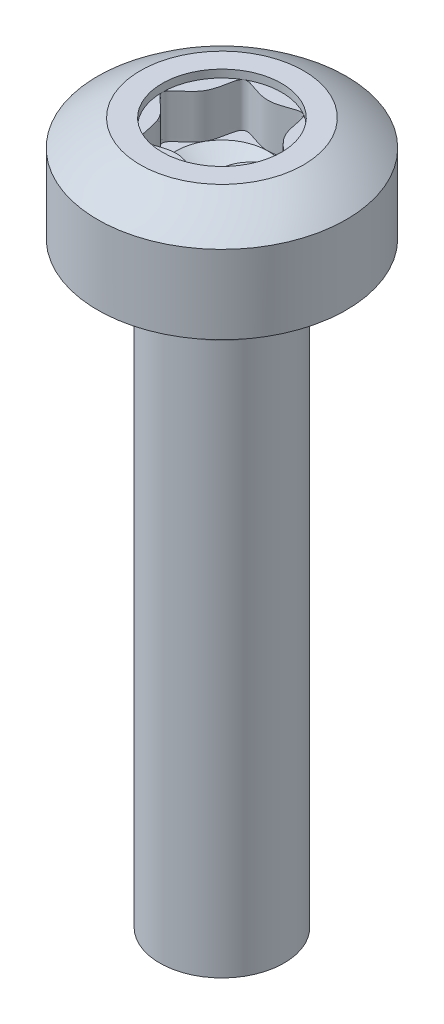
ISO-10303-21;
HEADER;
FILE_DESCRIPTION(('STEP AP214'),'2;1');
FILE_NAME('part.step','',(''),(''),'','','');
FILE_SCHEMA(('AUTOMOTIVE_DESIGN { 1 0 10303 214 1 1 1 1 }'));
ENDSEC;
DATA;
#1=APPLICATION_CONTEXT('core data for automotive mechanical design processes');
#2=APPLICATION_PROTOCOL_DEFINITION('international standard','automotive_design',2000,#1);
#3=PRODUCT_CONTEXT('',#1,'mechanical');
#4=PRODUCT('Part','Part','',(#3));
#5=PRODUCT_RELATED_PRODUCT_CATEGORY('part','',(#4));
#6=PRODUCT_DEFINITION_FORMATION('','',#4);
#7=PRODUCT_DEFINITION_CONTEXT('part definition',#1,'design');
#8=PRODUCT_DEFINITION('design','',#6,#7);
#9=PRODUCT_DEFINITION_SHAPE('','',#8);
#10=(LENGTH_UNIT() NAMED_UNIT(*) SI_UNIT(.MILLI.,.METRE.));
#11=(NAMED_UNIT(*) PLANE_ANGLE_UNIT() SI_UNIT($,.RADIAN.));
#12=(NAMED_UNIT(*) SI_UNIT($,.STERADIAN.) SOLID_ANGLE_UNIT());
#13=UNCERTAINTY_MEASURE_WITH_UNIT(LENGTH_MEASURE(1.E-05),#10,'distance_accuracy_value','');
#14=(GEOMETRIC_REPRESENTATION_CONTEXT(3) GLOBAL_UNCERTAINTY_ASSIGNED_CONTEXT((#13)) GLOBAL_UNIT_ASSIGNED_CONTEXT((#10,
#11,#12)) REPRESENTATION_CONTEXT('',''));
#15=CARTESIAN_POINT('',(0.,0.,0.));
#16=DIRECTION('',(0.,0.,1.));
#17=DIRECTION('',(1.,0.,0.));
#18=AXIS2_PLACEMENT_3D('',#15,#16,#17);
#19=CARTESIAN_POINT('',(0.,0.,0.));
#20=DIRECTION('',(0.,-1.,0.));
#21=DIRECTION('',(0.,0.,-1.));
#22=AXIS2_PLACEMENT_3D('',#19,#20,#21);
#23=CYLINDRICAL_SURFACE('',#22,2.5);
#24=CARTESIAN_POINT('',(0.,12.,0.));
#25=DIRECTION('',(0.,-1.,0.));
#26=DIRECTION('',(0.,0.,-1.));
#27=AXIS2_PLACEMENT_3D('',#24,#25,#26);
#28=CIRCLE('',#27,2.5);
#29=CARTESIAN_POINT('',(0.,12.,-2.5));
#30=VERTEX_POINT('',#29);
#31=EDGE_CURVE('E139',#30,#30,#28,.T.);
#32=ORIENTED_EDGE('',*,*,#31,.F.);
#33=EDGE_LOOP('',(#32));
#34=FACE_BOUND('',#33,.T.);
#35=CARTESIAN_POINT('',(0.,13.575,0.));
#36=DIRECTION('',(0.,-1.,0.));
#37=DIRECTION('',(0.,0.,-1.));
#38=AXIS2_PLACEMENT_3D('',#35,#36,#37);
#39=CIRCLE('',#38,2.5);
#40=CARTESIAN_POINT('',(2.5,13.575,0.));
#41=VERTEX_POINT('',#40);
#42=EDGE_CURVE('E144',#41,#41,#39,.T.);
#43=ORIENTED_EDGE('',*,*,#42,.T.);
#44=EDGE_LOOP('',(#43));
#45=FACE_BOUND('',#44,.T.);
#46=ADVANCED_FACE('F41',(#34,#45),#23,.T.);
#47=CARTESIAN_POINT('',(1.25,12.,0.));
#48=DIRECTION('',(0.,-1.,0.));
#49=DIRECTION('',(0.,0.,-1.));
#50=AXIS2_PLACEMENT_3D('',#47,#48,#49);
#51=PLANE('',#50);
#52=ORIENTED_EDGE('',*,*,#31,.T.);
#53=EDGE_LOOP('',(#52));
#54=FACE_BOUND('',#53,.T.);
#55=CARTESIAN_POINT('',(0.,12.,0.));
#56=DIRECTION('',(0.,-1.,0.));
#57=DIRECTION('',(0.,0.,-1.));
#58=AXIS2_PLACEMENT_3D('',#55,#56,#57);
#59=CIRCLE('',#58,1.25);
#60=CARTESIAN_POINT('',(0.,12.,-1.25));
#61=VERTEX_POINT('',#60);
#62=EDGE_CURVE('E304',#61,#61,#59,.T.);
#63=ORIENTED_EDGE('',*,*,#62,.F.);
#64=EDGE_LOOP('',(#63));
#65=FACE_BOUND('',#64,.T.);
#66=ADVANCED_FACE('F273',(#54,#65),#51,.T.);
#67=CARTESIAN_POINT('',(0.,10.4525010008008,0.));
#68=DIRECTION('',(0.,-1.,0.));
#69=DIRECTION('',(1.,0.,0.));
#70=AXIS2_PLACEMENT_3D('',#67,#68,#69);
#71=SPHERICAL_SURFACE('',#70,4.);
#72=CARTESIAN_POINT('',(0.,14.1,0.));
#73=DIRECTION('',(0.,1.,0.));
#74=DIRECTION('',(0.,0.,1.));
#75=AXIS2_PLACEMENT_3D('',#72,#73,#74);
#76=CIRCLE('',#75,1.64187424939939);
#77=CARTESIAN_POINT('',(1.6418742493994,14.1,0.));
#78=VERTEX_POINT('',#77);
#79=EDGE_CURVE('E148',#78,#78,#76,.T.);
#80=CARTESIAN_POINT('',(2.5,13.575,0.));
#81=CARTESIAN_POINT('',(2.49179811667303,13.5815667633569,0.));
#82=CARTESIAN_POINT('',(2.48357035879982,13.5881012093958,0.));
#83=CARTESIAN_POINT('',(2.46706360738007,13.6011050642602,0.));
#84=CARTESIAN_POINT('',(2.45878461383353,13.6075744730857,0.));
#85=CARTESIAN_POINT('',(2.44217590448631,13.6204478509464,0.));
#86=CARTESIAN_POINT('',(2.43384618868563,13.6268518199815,0.));
#87=CARTESIAN_POINT('',(2.4171365522514,13.6395939208298,0.));
#88=CARTESIAN_POINT('',(2.40875663161786,13.645932052643,0.));
#89=CARTESIAN_POINT('',(2.39194710582831,13.6585420854141,0.));
#90=CARTESIAN_POINT('',(2.3835175006723,13.6648139863721,0.));
#91=CARTESIAN_POINT('',(2.36660912929461,13.67729116799,0.));
#92=CARTESIAN_POINT('',(2.35813036307294,13.6834964486499,0.));
#93=CARTESIAN_POINT('',(2.34112419605702,13.6958400043448,0.));
#94=CARTESIAN_POINT('',(2.33259679526277,13.7019782793799,0.));
#95=CARTESIAN_POINT('',(2.31549388861922,13.7141874426645,0.));
#96=CARTESIAN_POINT('',(2.30691838276991,13.7202583309141,0.));
#97=CARTESIAN_POINT('',(2.28971979851967,13.7323323436503,0.));
#98=CARTESIAN_POINT('',(2.28109672011874,13.738335468137,0.));
#99=CARTESIAN_POINT('',(2.26380352622309,13.7502735805781,0.));
#100=CARTESIAN_POINT('',(2.25513341072836,13.7562085685325,0.));
#101=CARTESIAN_POINT('',(2.23774668102368,13.7680100393707,0.));
#102=CARTESIAN_POINT('',(2.22903006681372,13.7738765222544,0.));
#103=CARTESIAN_POINT('',(2.2115508809445,13.7855406186668,0.));
#104=CARTESIAN_POINT('',(2.20278830928525,13.7913382321955,0.));
#105=CARTESIAN_POINT('',(2.18521775263718,13.8028642298896,0.));
#106=CARTESIAN_POINT('',(2.17640976764836,13.8085926140551,0.));
#107=CARTESIAN_POINT('',(2.15874893128084,13.8199797973138,0.));
#108=CARTESIAN_POINT('',(2.14989607990214,13.8256385964071,0.));
#109=CARTESIAN_POINT('',(2.13214606048059,13.8368862581331,0.));
#110=CARTESIAN_POINT('',(2.12324889243774,13.8424751207659,0.));
#111=CARTESIAN_POINT('',(2.10541079216548,13.8535825625255,0.));
#112=CARTESIAN_POINT('',(2.09646985993607,13.8591011416525,0.));
#113=CARTESIAN_POINT('',(2.07854478648588,13.8700676737193,0.));
#114=CARTESIAN_POINT('',(2.06956064526509,13.8755156266593,0.));
#115=CARTESIAN_POINT('',(2.05154971171041,13.8863405680567,0.));
#116=CARTESIAN_POINT('',(2.04252291937652,13.8917175565141,0.));
#117=CARTESIAN_POINT('',(2.02442724412237,13.9024002350577,0.));
#118=CARTESIAN_POINT('',(2.01535836120211,13.9077059251437,0.));
#119=CARTESIAN_POINT('',(1.99717906791562,13.9182456774829,0.));
#120=CARTESIAN_POINT('',(1.98806865754938,13.9234797397361,0.));
#121=CARTESIAN_POINT('',(1.96980687509001,13.9338759113956,0.));
#122=CARTESIAN_POINT('',(1.96065550299687,13.939038020802,0.));
#123=CARTESIAN_POINT('',(1.94231236534631,13.9492899662223,0.));
#124=CARTESIAN_POINT('',(1.93312059978889,13.9543798022362,0.));
#125=CARTESIAN_POINT('',(1.91469724598067,13.9644868848136,0.));
#126=CARTESIAN_POINT('',(1.90546565772987,13.969504131377,0.));
#127=CARTESIAN_POINT('',(1.88696323177861,13.9794657235031,0.));
#128=CARTESIAN_POINT('',(1.87769239407816,13.9844100690657,0.));
#129=CARTESIAN_POINT('',(1.8591120449085,13.9942255521665,0.));
#130=CARTESIAN_POINT('',(1.84980253343931,13.9990966897047,0.));
#131=CARTESIAN_POINT('',(1.83114541481477,14.0087654542793,0.));
#132=CARTESIAN_POINT('',(1.82179780765943,14.0135630813157,0.));
#133=CARTESIAN_POINT('',(1.80306507810999,14.0230845269725,0.));
#134=CARTESIAN_POINT('',(1.7936799557159,14.0278083455928,0.));
#135=CARTESIAN_POINT('',(1.77487277846887,14.0371818810928,0.));
#136=CARTESIAN_POINT('',(1.76545072361592,14.0418315979725,0.));
#137=CARTESIAN_POINT('',(1.74657026651338,14.0510566412438,0.));
#138=CARTESIAN_POINT('',(1.73711186426377,14.0556319676355,0.));
#139=CARTESIAN_POINT('',(1.71815929972841,14.0647079458926,0.));
#140=CARTESIAN_POINT('',(1.70866513744266,14.0692085977582,0.));
#141=CARTESIAN_POINT('',(1.68964164226191,14.0781349472266,0.));
#142=CARTESIAN_POINT('',(1.68011230936692,14.0825606448295,0.));
#143=CARTESIAN_POINT('',(1.66101906515389,14.0913368119422,0.));
#144=CARTESIAN_POINT('',(1.65145515383586,14.095687281452,0.));
#145=CARTESIAN_POINT('',(1.6418742493994,14.1,0.));
#146=B_SPLINE_CURVE_WITH_KNOTS('',3,(#80,#81,#82,#83,#84,#85,#86,#87,#88,#89,#90,#91,#92,#93,
#94,#95,#96,#97,#98,#99,#100,#101,#102,#103,#104,#105,#106,#107,#108,#109,#110,#111,#112,#113,
#114,#115,#116,#117,#118,#119,#120,#121,#122,#123,#124,#125,#126,#127,#128,#129,#130,#131,#132,
#133,#134,#135,#136,#137,#138,#139,#140,#141,#142,#143,#144,#145),.UNSPECIFIED.,.F.,.F.,(4,2,2,
2,2,2,2,2,2,2,2,2,2,2,2,2,2,2,2,2,2,2,2,2,2,2,2,2,2,2,2,2,4),(0.,0.031520379078916,
0.0630407581578309,0.0945611372367469,0.126081516315661,0.157601895394577,0.189122274473493,
0.220642653552408,0.252163032631323,0.283683411710238,0.315203790789154,0.34672416986807,
0.378244548946984,0.409764928025899,0.441285307104814,0.472805686183729,0.504326065262645,
0.535846444341561,0.567366823420476,0.598887202499391,0.630407581578306,0.661927960657221,
0.693448339736136,0.724968718815052,0.756489097893967,0.788009476972882,0.819529856051798,
0.851050235130713,0.882570614209628,0.914090993288543,0.945611372367459,0.977131751446374,
1.00865213052529),.UNSPECIFIED.);
#147=EDGE_CURVE('BSEAM279',#41,#78,#146,.T.);
#148=ORIENTED_EDGE('',*,*,#42,.F.);
#149=ORIENTED_EDGE('',*,*,#79,.F.);
#150=ORIENTED_EDGE('',*,*,#147,.T.);
#151=ORIENTED_EDGE('',*,*,#147,.F.);
#152=EDGE_LOOP('',(#148,#150,#149,#151));
#153=FACE_BOUND('',#152,.T.);
#154=ADVANCED_FACE('F279',(#153),#71,.T.);
#155=CARTESIAN_POINT('',(2.5,14.1,0.));
#156=DIRECTION('',(0.,1.,0.));
#157=DIRECTION('',(0.,0.,1.));
#158=AXIS2_PLACEMENT_3D('',#155,#156,#157);
#159=PLANE('',#158);
#160=CARTESIAN_POINT('',(0.,14.1,0.));
#161=DIRECTION('',(0.,1.,0.));
#162=DIRECTION('',(0.,0.,1.));
#163=AXIS2_PLACEMENT_3D('',#160,#161,#162);
#164=CIRCLE('',#163,1.2);
#165=CARTESIAN_POINT('',(0.,14.1,1.2));
#166=VERTEX_POINT('',#165);
#167=EDGE_CURVE('E324',#166,#166,#164,.T.);
#168=ORIENTED_EDGE('',*,*,#167,.F.);
#169=EDGE_LOOP('',(#168));
#170=FACE_BOUND('',#169,.T.);
#171=ORIENTED_EDGE('',*,*,#79,.T.);
#172=EDGE_LOOP('',(#171));
#173=FACE_BOUND('',#172,.T.);
#174=ADVANCED_FACE('F285',(#170,#173),#159,.T.);
#175=CARTESIAN_POINT('',(0.,11.1,0.));
#176=DIRECTION('',(0.,-1.,0.));
#177=DIRECTION('',(0.,0.,-1.));
#178=AXIS2_PLACEMENT_3D('',#175,#176,#177);
#179=CONICAL_SURFACE('',#178,1.25,0.0765436920382642);
#180=CARTESIAN_POINT('',(0.,11.9,0.));
#181=DIRECTION('',(0.,-1.,0.));
#182=DIRECTION('',(0.,0.,-1.));
#183=AXIS2_PLACEMENT_3D('',#180,#181,#182);
#184=CIRCLE('',#183,1.18864517485947);
#185=CARTESIAN_POINT('',(0.,11.9,-1.18864517485947));
#186=VERTEX_POINT('',#185);
#187=EDGE_CURVE('E301',#186,#186,#184,.T.);
#188=ORIENTED_EDGE('',*,*,#187,.T.);
#189=EDGE_LOOP('',(#188));
#190=FACE_BOUND('',#189,.T.);
#191=CARTESIAN_POINT('',(0.,11.1,0.));
#192=DIRECTION('',(0.,-1.,0.));
#193=DIRECTION('',(0.,0.,-1.));
#194=AXIS2_PLACEMENT_3D('',#191,#192,#193);
#195=CIRCLE('',#194,1.25);
#196=CARTESIAN_POINT('',(0.,11.1,-1.25));
#197=VERTEX_POINT('',#196);
#198=EDGE_CURVE('E151',#197,#197,#195,.T.);
#199=ORIENTED_EDGE('',*,*,#198,.F.);
#200=EDGE_LOOP('',(#199));
#201=FACE_BOUND('',#200,.T.);
#202=ADVANCED_FACE('F315',(#190,#201),#179,.T.);
#203=CARTESIAN_POINT('',(0.,11.9076468969822,0.));
#204=DIRECTION('',(0.,-1.,0.));
#205=DIRECTION('',(0.,0.,-1.));
#206=AXIS2_PLACEMENT_3D('',#203,#204,#205);
#207=TOROIDAL_SURFACE('',#206,1.28835237102175,0.100000000000003);
#208=ORIENTED_EDGE('',*,*,#62,.T.);
#209=EDGE_LOOP('',(#208));
#210=FACE_BOUND('',#209,.T.);
#211=ORIENTED_EDGE('',*,*,#187,.F.);
#212=EDGE_LOOP('',(#211));
#213=FACE_BOUND('',#212,.T.);
#214=ADVANCED_FACE('F296',(#210,#213),#207,.F.);
#215=CARTESIAN_POINT('',(0.,0.,0.));
#216=DIRECTION('',(0.,-1.,0.));
#217=DIRECTION('',(0.,0.,-1.));
#218=AXIS2_PLACEMENT_3D('',#215,#216,#217);
#219=PLANE('',#218);
#220=CARTESIAN_POINT('',(0.,0.,0.));
#221=DIRECTION('',(0.,-1.,0.));
#222=DIRECTION('',(0.,0.,-1.));
#223=AXIS2_PLACEMENT_3D('',#220,#221,#222);
#224=CIRCLE('',#223,1.25);
#225=CARTESIAN_POINT('',(0.,0.,-1.25));
#226=VERTEX_POINT('',#225);
#227=EDGE_CURVE('E135',#226,#226,#224,.T.);
#228=ORIENTED_EDGE('',*,*,#227,.T.);
#229=EDGE_LOOP('',(#228));
#230=FACE_BOUND('',#229,.T.);
#231=ADVANCED_FACE('F43',(#230),#219,.T.);
#232=CARTESIAN_POINT('',(0.,0.,0.));
#233=DIRECTION('',(0.,-1.,0.));
#234=DIRECTION('',(0.,0.,-1.));
#235=AXIS2_PLACEMENT_3D('',#232,#233,#234);
#236=CYLINDRICAL_SURFACE('',#235,1.25);
#237=ORIENTED_EDGE('',*,*,#227,.F.);
#238=EDGE_LOOP('',(#237));
#239=FACE_BOUND('',#238,.T.);
#240=ORIENTED_EDGE('',*,*,#198,.T.);
#241=EDGE_LOOP('',(#240));
#242=FACE_BOUND('',#241,.T.);
#243=ADVANCED_FACE('F287',(#239,#242),#236,.T.);
#244=CARTESIAN_POINT('',(0.,13.944,0.));
#245=DIRECTION('',(0.,1.,0.));
#246=DIRECTION('',(0.,0.,1.));
#247=AXIS2_PLACEMENT_3D('',#244,#245,#246);
#248=CYLINDRICAL_SURFACE('',#247,1.2);
#249=ORIENTED_EDGE('',*,*,#167,.T.);
#250=EDGE_LOOP('',(#249));
#251=FACE_BOUND('',#250,.T.);
#252=CARTESIAN_POINT('',(0.,13.944,0.));
#253=DIRECTION('',(0.,1.,0.));
#254=DIRECTION('',(0.,0.,1.));
#255=AXIS2_PLACEMENT_3D('',#252,#253,#254);
#256=CIRCLE('',#255,1.2);
#257=CARTESIAN_POINT('',(-0.599999999999995,13.944,1.03923048454133));
#258=VERTEX_POINT('',#257);
#259=CARTESIAN_POINT('',(0.600000000000006,13.944,1.03923048454132));
#260=VERTEX_POINT('',#259);
#261=EDGE_CURVE('E121',#258,#260,#256,.T.);
#262=ORIENTED_EDGE('',*,*,#261,.F.);
#263=CARTESIAN_POINT('',(-1.2,13.944,0.));
#264=VERTEX_POINT('',#263);
#265=EDGE_CURVE('E326',#264,#258,#256,.T.);
#266=ORIENTED_EDGE('',*,*,#265,.F.);
#267=CARTESIAN_POINT('',(-0.600000000000005,13.944,-1.03923048454132));
#268=VERTEX_POINT('',#267);
#269=EDGE_CURVE('E376',#268,#264,#256,.T.);
#270=ORIENTED_EDGE('',*,*,#269,.F.);
#271=CARTESIAN_POINT('',(0.599999999999994,13.944,-1.03923048454133));
#272=VERTEX_POINT('',#271);
#273=EDGE_CURVE('E114',#272,#268,#256,.T.);
#274=ORIENTED_EDGE('',*,*,#273,.F.);
#275=CARTESIAN_POINT('',(1.2,13.944,0.));
#276=VERTEX_POINT('',#275);
#277=EDGE_CURVE('E104',#276,#272,#256,.T.);
#278=ORIENTED_EDGE('',*,*,#277,.F.);
#279=EDGE_CURVE('E59',#260,#276,#256,.T.);
#280=ORIENTED_EDGE('',*,*,#279,.F.);
#281=EDGE_LOOP('',(#262,#266,#270,#274,#278,#280));
#282=FACE_BOUND('',#281,.T.);
#283=ADVANCED_FACE('F111',(#251,#282),#248,.F.);
#284=CARTESIAN_POINT('',(0.,13.944,0.));
#285=DIRECTION('',(0.,1.,0.));
#286=DIRECTION('',(0.,0.,1.));
#287=AXIS2_PLACEMENT_3D('',#284,#285,#286);
#288=PLANE('',#287);
#289=CARTESIAN_POINT('',(0.,13.944,0.923076923076923));
#290=CARTESIAN_POINT('',(0.246244913072035,13.944,0.923076923076921));
#291=CARTESIAN_POINT('',(0.738734739216103,13.944,1.27952610163842));
#292=CARTESIAN_POINT('',(0.645061043135613,13.944,0.372426166898084));
#293=CARTESIAN_POINT('',(1.47746947843219,13.944,0.));
#294=CARTESIAN_POINT('',(0.645061043135611,13.944,-0.372426166898088));
#295=CARTESIAN_POINT('',(0.738734739216091,13.944,-1.27952610163843));
#296=CARTESIAN_POINT('',(0.,13.944,-0.744852333796172));
#297=CARTESIAN_POINT('',(-0.738734739216103,13.944,-1.27952610163842));
#298=CARTESIAN_POINT('',(-0.645061043135614,13.944,-0.372426166898084));
#299=CARTESIAN_POINT('',(-1.47746947843219,13.944,0.));
#300=CARTESIAN_POINT('',(-0.645061043135611,13.944,0.372426166898088));
#301=CARTESIAN_POINT('',(-0.738734739216091,13.944,1.27952610163843));
#302=CARTESIAN_POINT('',(-0.24624491307203,13.944,0.923076923076925));
#303=CARTESIAN_POINT('',(0.,13.944,0.923076923076923));
#304=B_SPLINE_CURVE_WITH_KNOTS('',3,(#289,#290,#291,#292,#293,#294,#295,#296,#297,#298,#299,
#300,#301,#302,#303),.UNSPECIFIED.,.T.,.F.,(4,1,1,1,1,1,1,1,1,1,1,1,4),(0.,0.0833333333333341,
0.166666666666667,0.250000000000001,0.333333333333333,0.416666666666667,0.5,0.583333333333334,
0.666666666666667,0.750000000000001,0.833333333333333,0.916666666666667,1.),.UNSPECIFIED.);
#305=EDGE_CURVE('E11',#258,#264,#304,.F.);
#306=ORIENTED_EDGE('',*,*,#305,.T.);
#307=ORIENTED_EDGE('',*,*,#265,.T.);
#308=EDGE_LOOP('',(#306,#307));
#309=FACE_BOUND('',#308,.T.);
#310=ADVANCED_FACE('F294',(#309),#288,.T.);
#311=EDGE_CURVE('E52',#264,#268,#304,.F.);
#312=ORIENTED_EDGE('',*,*,#311,.T.);
#313=ORIENTED_EDGE('',*,*,#269,.T.);
#314=EDGE_LOOP('',(#312,#313));
#315=FACE_BOUND('',#314,.T.);
#316=ADVANCED_FACE('F365',(#315),#288,.T.);
#317=EDGE_CURVE('E108',#268,#272,#304,.F.);
#318=ORIENTED_EDGE('',*,*,#317,.T.);
#319=ORIENTED_EDGE('',*,*,#273,.T.);
#320=EDGE_LOOP('',(#318,#319));
#321=FACE_BOUND('',#320,.T.);
#322=ADVANCED_FACE('F370',(#321),#288,.T.);
#323=EDGE_CURVE('E102',#272,#276,#304,.F.);
#324=ORIENTED_EDGE('',*,*,#323,.T.);
#325=ORIENTED_EDGE('',*,*,#277,.T.);
#326=EDGE_LOOP('',(#324,#325));
#327=FACE_BOUND('',#326,.T.);
#328=ADVANCED_FACE('F103',(#327),#288,.T.);
#329=EDGE_CURVE('E109',#276,#260,#304,.F.);
#330=ORIENTED_EDGE('',*,*,#329,.T.);
#331=ORIENTED_EDGE('',*,*,#279,.T.);
#332=EDGE_LOOP('',(#330,#331));
#333=FACE_BOUND('',#332,.T.);
#334=ADVANCED_FACE('F118',(#333),#288,.T.);
#335=EDGE_CURVE('E45',#260,#258,#304,.F.);
#336=ORIENTED_EDGE('',*,*,#335,.T.);
#337=ORIENTED_EDGE('',*,*,#261,.T.);
#338=EDGE_LOOP('',(#336,#337));
#339=FACE_BOUND('',#338,.T.);
#340=ADVANCED_FACE('F355',(#339),#288,.T.);
#341=CARTESIAN_POINT('',(0.,12.5270612899788,0.));
#342=DIRECTION('',(0.,1.,0.));
#343=DIRECTION('',(0.,0.,1.));
#344=AXIS2_PLACEMENT_3D('',#341,#342,#343);
#345=CONICAL_SURFACE('',#344,0.,1.04719755119659);
#346=CARTESIAN_POINT('',(-0.000394126476633877,13.06,-0.92307621114213));
#347=CARTESIAN_POINT('',(0.254474389957819,13.06,-0.923228980663994));
#348=CARTESIAN_POINT('',(0.458134571417908,13.06,-0.804252217712482));
#349=CARTESIAN_POINT('',(0.674117120568181,13.06,-0.678076819224236));
#350=CARTESIAN_POINT('',(0.8011066996897,13.06,-0.463002875994145));
#351=CARTESIAN_POINT('',(0.922045512170781,13.06,-0.258176720416603));
#352=CARTESIAN_POINT('',(0.923065253147436,13.06,-0.00595049263792314));
#353=CARTESIAN_POINT('',(0.924094367191551,13.06,0.248594101767663));
#354=CARTESIAN_POINT('',(0.806436681483717,13.06,0.454056413952659));
#355=B_SPLINE_CURVE_WITH_KNOTS('',2,(#346,#347,#348,#349,#350,#351,#352,#353,#354),
.UNSPECIFIED.,.F.,.F.,(3,2,2,2,3),(0.,0.25,0.5,0.75,1.),.UNSPECIFIED.);
#356=CARTESIAN_POINT('',(0.000503298113043001,13.06,-0.923077204547765));
#357=VERTEX_POINT('',#356);
#358=CARTESIAN_POINT('',(0.785999713706487,13.06,-0.485837326819558));
#359=VERTEX_POINT('',#358);
#360=EDGE_CURVE('E120',#357,#359,#355,.T.);
#361=ORIENTED_EDGE('',*,*,#360,.F.);
#362=CARTESIAN_POINT('',(0.,13.06,0.));
#363=DIRECTION('',(0.,1.,0.));
#364=DIRECTION('',(0.000545240147337114,0.,-0.99999985135658));
#365=AXIS2_PLACEMENT_3D('',#362,#363,#364);
#366=CIRCLE('',#365,0.923076923077);
#367=CARTESIAN_POINT('',(-0.804454306914702,13.06,-0.455110202791134));
#368=VERTEX_POINT('',#367);
#369=EDGE_CURVE('E126',#357,#368,#366,.T.);
#370=ORIENTED_EDGE('',*,*,#369,.T.);
#371=CARTESIAN_POINT('',(0.,13.06,0.));
#372=DIRECTION('',(0.,1.,0.));
#373=DIRECTION('',(-0.870374466387913,0.,-0.492390381973445));
#374=AXIS2_PLACEMENT_3D('',#371,#372,#373);
#375=CIRCLE('',#374,0.923076923077);
#376=CARTESIAN_POINT('',(-0.785983134370909,13.06,0.485863810223393));
#377=VERTEX_POINT('',#376);
#378=EDGE_CURVE('E124',#368,#377,#375,.T.);
#379=ORIENTED_EDGE('',*,*,#378,.T.);
#380=CARTESIAN_POINT('',(0.,13.06,0.));
#381=DIRECTION('',(0.,1.,0.));
#382=DIRECTION('',(-0.850608822829448,0.,0.525799040056845));
#383=AXIS2_PLACEMENT_3D('',#380,#381,#382);
#384=CIRCLE('',#383,0.923076923077);
#385=CARTESIAN_POINT('',(-0.00117277545001094,13.06,0.923075678455339));
#386=VERTEX_POINT('',#385);
#387=EDGE_CURVE('E130',#377,#386,#384,.T.);
#388=ORIENTED_EDGE('',*,*,#387,.T.);
#389=CARTESIAN_POINT('',(0.,13.06,0.));
#390=DIRECTION('',(0.,1.,0.));
#391=DIRECTION('',(-0.0016024787034284,0.,0.999998716030178));
#392=AXIS2_PLACEMENT_3D('',#389,#390,#391);
#393=CIRCLE('',#392,0.923076923077);
#394=CARTESIAN_POINT('',(0.804457605996592,13.06,0.455104432020455));
#395=VERTEX_POINT('',#394);
#396=EDGE_CURVE('E67',#386,#395,#393,.T.);
#397=ORIENTED_EDGE('',*,*,#396,.T.);
#398=CARTESIAN_POINT('',(0.,13.06,0.));
#399=DIRECTION('',(0.,1.,0.));
#400=DIRECTION('',(0.870378007416175,0.,0.49238412261795));
#401=AXIS2_PLACEMENT_3D('',#398,#399,#400);
#402=CIRCLE('',#401,0.923076923077);
#403=EDGE_CURVE('E134',#395,#359,#402,.T.);
#404=ORIENTED_EDGE('',*,*,#403,.T.);
#405=EDGE_LOOP('',(#361,#370,#379,#388,#397,#404));
#406=FACE_BOUND('',#405,.T.);
#407=CARTESIAN_POINT('',(0.,12.5270612899788,0.));
#408=VERTEX_POINT('',#407);
#409=VERTEX_LOOP('',#408);
#410=FACE_BOUND('',#409,.T.);
#411=ADVANCED_FACE('F177',(#406,#410),#345,.F.);
#412=CARTESIAN_POINT('',(0.,13.06,0.));
#413=DIRECTION('',(0.,1.,0.));
#414=DIRECTION('',(0.,0.,1.));
#415=AXIS2_PLACEMENT_3D('',#412,#413,#414);
#416=PLANE('',#415);
#417=ORIENTED_EDGE('',*,*,#360,.T.);
#418=CARTESIAN_POINT('',(0.000448557537352161,13.06,-0.923077120111183));
#419=CARTESIAN_POINT('',(0.246543900301098,13.06,-0.923293269379213));
#420=CARTESIAN_POINT('',(0.729447696743124,13.06,-1.27263774642243));
#421=CARTESIAN_POINT('',(0.678440186885353,13.06,-0.697220714218915));
#422=CARTESIAN_POINT('',(0.786141930724429,13.06,-0.485987273540275));
#423=B_SPLINE_CURVE_WITH_KNOTS('',3,(#418,#419,#420,#421,#422),.UNSPECIFIED.,.F.,.F.,(4,1,4),
(0.33647087857543,0.419753612153014,0.499949400244251),.UNSPECIFIED.);
#424=EDGE_CURVE('E244',#359,#357,#423,.F.);
#425=ORIENTED_EDGE('',*,*,#424,.T.);
#426=EDGE_LOOP('',(#417,#425));
#427=FACE_BOUND('',#426,.T.);
#428=ADVANCED_FACE('F176',(#427),#416,.T.);
#429=ORIENTED_EDGE('',*,*,#369,.F.);
#430=CARTESIAN_POINT('',(-0.803516205869057,13.06,-0.454550596886052));
#431=CARTESIAN_POINT('',(-0.802128622472905,13.06,-0.456869234436128));
#432=CARTESIAN_POINT('',(-0.675942990397297,13.06,-0.671475030323492));
#433=CARTESIAN_POINT('',(-0.738734739216103,13.06,-1.27952610163842));
#434=CARTESIAN_POINT('',(-0.246095393882565,13.06,-0.922968705628688));
#435=CARTESIAN_POINT('',(0.000299038378940154,13.06,-0.92307698878624));
#436=CARTESIAN_POINT('',(0.000448557537352161,13.06,-0.923077120111183));
#437=B_SPLINE_CURVE_WITH_KNOTS('',3,(#430,#431,#432,#433,#434,#435,#436),.UNSPECIFIED.,.F.,.F.,
(4,1,1,1,4),(0.499949400244251,0.500863792738665,0.584197126071998,0.667530459405332,
0.667581059161081),.UNSPECIFIED.);
#438=EDGE_CURVE('E233',#357,#368,#437,.F.);
#439=ORIENTED_EDGE('',*,*,#438,.T.);
#440=EDGE_LOOP('',(#429,#439));
#441=FACE_BOUND('',#440,.T.);
#442=ADVANCED_FACE('F243',(#441),#416,.T.);
#443=ORIENTED_EDGE('',*,*,#378,.F.);
#444=CARTESIAN_POINT('',(-0.786127686707834,13.06,0.486015211998952));
#445=CARTESIAN_POINT('',(-0.790345652947227,13.06,0.477741448442666));
#446=CARTESIAN_POINT('',(-0.912071872798328,13.06,0.252963394063342));
#447=CARTESIAN_POINT('',(-1.47442488633011,13.06,0.00136217476694663));
#448=CARTESIAN_POINT('',(-0.928586298345982,13.06,-0.245559761731508));
#449=CARTESIAN_POINT('',(-0.803516205869057,13.06,-0.454550596886052));
#450=B_SPLINE_CURVE_WITH_KNOTS('',3,(#444,#445,#446,#447,#448,#449),.UNSPECIFIED.,.F.,.F.,(4,1,
1,4),(0.667581059161081,0.670722140007334,0.754055473340667,0.836474414179587),.UNSPECIFIED.);
#451=EDGE_CURVE('E225',#368,#377,#450,.F.);
#452=ORIENTED_EDGE('',*,*,#451,.T.);
#453=EDGE_LOOP('',(#443,#452));
#454=FACE_BOUND('',#453,.T.);
#455=ADVANCED_FACE('F175',(#454),#416,.T.);
#456=ORIENTED_EDGE('',*,*,#387,.F.);
#457=CARTESIAN_POINT('',(-0.000605745227797699,13.06,0.923077282340431));
#458=CARTESIAN_POINT('',(-0.24664864999494,13.06,0.923369041547261));
#459=CARTESIAN_POINT('',(-0.729431721563848,13.06,1.27256778080041));
#460=CARTESIAN_POINT('',(-0.678442392948255,13.06,0.697245603256004));
#461=CARTESIAN_POINT('',(-0.786127686707834,13.06,0.486015211998951));
#462=B_SPLINE_CURVE_WITH_KNOTS('',3,(#457,#458,#459,#460,#461),.UNSPECIFIED.,.F.,.F.,(4,1,4),
(0.836474414179586,0.919739416117795,0.999931668604876),.UNSPECIFIED.);
#463=EDGE_CURVE('E238',#377,#386,#462,.F.);
#464=ORIENTED_EDGE('',*,*,#463,.T.);
#465=EDGE_LOOP('',(#456,#464));
#466=FACE_BOUND('',#465,.T.);
#467=ADVANCED_FACE('F265',(#466),#416,.T.);
#468=ORIENTED_EDGE('',*,*,#396,.F.);
#469=CARTESIAN_POINT('',(0.803519663959591,13.06,0.454544818536702));
#470=CARTESIAN_POINT('',(0.799541930541342,13.06,0.461186339356069));
#471=CARTESIAN_POINT('',(0.795719692199895,13.06,0.467919530600799));
#472=CARTESIAN_POINT('',(0.788367932598857,13.06,0.481548447549084));
#473=CARTESIAN_POINT('',(0.784838559499837,13.06,0.488444253281233));
#474=CARTESIAN_POINT('',(0.778054970520867,13.06,0.502377548806618));
#475=CARTESIAN_POINT('',(0.774801022019245,13.06,0.509415168249864));
#476=CARTESIAN_POINT('',(0.76854973509612,13.06,0.523611725151016));
#477=CARTESIAN_POINT('',(0.765552661627679,13.06,0.530770778960399));
#478=CARTESIAN_POINT('',(0.759796966307186,13.06,0.545189823320042));
#479=CARTESIAN_POINT('',(0.757038518066542,13.06,0.552449882972563));
#480=CARTESIAN_POINT('',(0.751742031145187,13.06,0.567050448753726));
#481=CARTESIAN_POINT('',(0.749204015824848,13.06,0.57439096331597));
#482=CARTESIAN_POINT('',(0.741899019039474,13.06,0.596485080414518));
#483=CARTESIAN_POINT('',(0.737430688291614,13.06,0.611337789815062));
#484=CARTESIAN_POINT('',(0.729160942833001,13.06,0.641117353456801));
#485=CARTESIAN_POINT('',(0.725355281557085,13.06,0.65604305370402));
#486=CARTESIAN_POINT('',(0.718265459581308,13.06,0.685807786018222));
#487=CARTESIAN_POINT('',(0.714975059739522,13.06,0.700645347960541));
#488=CARTESIAN_POINT('',(0.705804761576768,13.06,0.74418748802369));
#489=CARTESIAN_POINT('',(0.700356101086562,13.06,0.772980249191303));
#490=CARTESIAN_POINT('',(0.69226917346853,13.06,0.815362545361473));
#491=CARTESIAN_POINT('',(0.689664533851542,13.06,0.828960087821595));
#492=CARTESIAN_POINT('',(0.68438389536103,13.06,0.855415092642418));
#493=CARTESIAN_POINT('',(0.681718473316325,13.06,0.868274617349487));
#494=CARTESIAN_POINT('',(0.676161490324226,13.06,0.893091275052796));
#495=CARTESIAN_POINT('',(0.673295086161844,13.06,0.905053793206742));
#496=CARTESIAN_POINT('',(0.66860704320725,13.06,0.922536645061781));
#497=CARTESIAN_POINT('',(0.667033085903274,13.06,0.92812283767844));
#498=CARTESIAN_POINT('',(0.663770619281648,13.06,0.939006409851694));
#499=CARTESIAN_POINT('',(0.662089722540415,13.06,0.944306047238867));
#500=CARTESIAN_POINT('',(0.658593793691293,13.06,0.954595346054372));
#501=CARTESIAN_POINT('',(0.656788240393167,13.06,0.959588201794068));
#502=CARTESIAN_POINT('',(0.653022425569197,13.06,0.969243172767157));
#503=CARTESIAN_POINT('',(0.651073663187484,13.06,0.973909699045107));
#504=CARTESIAN_POINT('',(0.64798077676371,13.06,0.98072895903666));
#505=CARTESIAN_POINT('',(0.646943487525579,13.06,0.982930285974701));
#506=CARTESIAN_POINT('',(0.644824288020671,13.06,0.987242456781296));
#507=CARTESIAN_POINT('',(0.643744174817123,13.06,0.989354179917909));
#508=CARTESIAN_POINT('',(0.641537014181358,13.06,0.993484444846447));
#509=CARTESIAN_POINT('',(0.640411852399452,13.06,0.995503991503453));
#510=CARTESIAN_POINT('',(0.6381122059303,13.06,0.999447230234967));
#511=CARTESIAN_POINT('',(0.636939671177068,13.06,1.00137205576312));
#512=CARTESIAN_POINT('',(0.634542947409564,13.06,1.00512316479084));
#513=CARTESIAN_POINT('',(0.633320735334165,13.06,1.00695070747821));
#514=CARTESIAN_POINT('',(0.63082234572871,13.06,1.0105045830723));
#515=CARTESIAN_POINT('',(0.629548125267455,13.06,1.01223228703011));
#516=CARTESIAN_POINT('',(0.626943509577046,13.06,1.01558378747156));
#517=CARTESIAN_POINT('',(0.625614992433684,13.06,1.01720903994633));
#518=CARTESIAN_POINT('',(0.622899460721576,13.06,1.02035313587262));
#519=CARTESIAN_POINT('',(0.621514182154129,13.06,1.02187347004894));
#520=CARTESIAN_POINT('',(0.619381851423189,13.06,1.02408154097413));
#521=CARTESIAN_POINT('',(0.618667170888165,13.06,1.02480072639314));
#522=CARTESIAN_POINT('',(0.617222640747477,13.06,1.02621170575735));
#523=CARTESIAN_POINT('',(0.616492963912233,13.06,1.02690367614523));
#524=CARTESIAN_POINT('',(0.615018195407867,13.06,1.02825988711806));
#525=CARTESIAN_POINT('',(0.614273257429889,13.06,1.02892429478708));
#526=CARTESIAN_POINT('',(0.612767696167845,13.06,1.03022507806522));
#527=CARTESIAN_POINT('',(0.612007205865703,13.06,1.03086160747));
#528=CARTESIAN_POINT('',(0.610470278183619,13.06,1.03210632672494));
#529=CARTESIAN_POINT('',(0.609693951487259,13.06,1.03271465316114));
#530=CARTESIAN_POINT('',(0.6081250896776,13.06,1.03390266667911));
#531=CARTESIAN_POINT('',(0.607332641798793,13.06,1.03448246889203));
#532=CARTESIAN_POINT('',(0.605731274860084,13.06,1.03561313273507));
#533=CARTESIAN_POINT('',(0.60492241889874,13.06,1.03616408368685));
#534=CARTESIAN_POINT('',(0.603287984694976,13.06,1.03723676718298));
#535=CARTESIAN_POINT('',(0.602462445221813,13.06,1.03775855877049));
#536=CARTESIAN_POINT('',(0.600794351325595,13.06,1.03877257992251));
#537=CARTESIAN_POINT('',(0.599951811817159,13.06,1.03926483401261));
#538=CARTESIAN_POINT('',(0.598249607369072,13.06,1.04021972913559));
#539=CARTESIAN_POINT('',(0.597389934692732,13.06,1.04068235637375));
#540=CARTESIAN_POINT('',(0.595653668134895,13.06,1.04157851998942));
#541=CARTESIAN_POINT('',(0.594777047366273,13.06,1.04201200424461));
#542=CARTESIAN_POINT('',(0.593007025019202,13.06,1.04285030551513));
#543=CARTESIAN_POINT('',(0.592113581348367,13.06,1.04325503360291));
#544=CARTESIAN_POINT('',(0.590310064701857,13.06,1.04403627061404));
#545=CARTESIAN_POINT('',(0.589399938280111,13.06,1.04441265606693));
#546=CARTESIAN_POINT('',(0.587563202678819,13.06,1.04513764594582));
#547=CARTESIAN_POINT('',(0.586636532238204,13.06,1.04548609500553));
#548=CARTESIAN_POINT('',(0.584766840874174,13.06,1.04615565139561));
#549=CARTESIAN_POINT('',(0.583823754001694,13.06,1.04647657451685));
#550=CARTESIAN_POINT('',(0.58192140346728,13.06,1.04709150687041));
#551=CARTESIAN_POINT('',(0.580962072270548,13.06,1.04738530627063));
#552=CARTESIAN_POINT('',(0.578047575222314,13.06,1.04823056497038));
#553=CARTESIAN_POINT('',(0.576079351454507,13.06,1.04873753245408));
#554=CARTESIAN_POINT('',(0.572080201634642,13.06,1.04964982295956));
#555=CARTESIAN_POINT('',(0.570048796291589,13.06,1.0500530167768));
#556=CARTESIAN_POINT('',(0.565924101110568,13.06,1.05076131313521));
#557=CARTESIAN_POINT('',(0.563830419847789,13.06,1.05106411999905));
#558=CARTESIAN_POINT('',(0.559582189750293,13.06,1.05157501114049));
#559=CARTESIAN_POINT('',(0.55742735962605,13.06,1.05178072314238));
#560=CARTESIAN_POINT('',(0.553057773222919,13.06,1.05210072961189));
#561=CARTESIAN_POINT('',(0.550842846659939,13.06,1.05221265097879));
#562=CARTESIAN_POINT('',(0.54635402866498,13.06,1.05234830512759));
#563=CARTESIAN_POINT('',(0.544080070599029,13.06,1.05236972205146));
#564=CARTESIAN_POINT('',(0.539474155840201,13.06,1.05232754636753));
#565=CARTESIAN_POINT('',(0.537142222415582,13.06,1.05226173759016));
#566=CARTESIAN_POINT('',(0.532421343955191,13.06,1.05204824804459));
#567=CARTESIAN_POINT('',(0.530032496042842,13.06,1.05189847938796));
#568=CARTESIAN_POINT('',(0.525198777521734,13.06,1.05152019741124));
#569=CARTESIAN_POINT('',(0.522754060926421,13.06,1.05128974241373));
#570=CARTESIAN_POINT('',(0.517809669481363,13.06,1.05075314568899));
#571=CARTESIAN_POINT('',(0.515310191474543,13.06,1.05044521595352));
#572=CARTESIAN_POINT('',(0.507636797023763,13.06,1.04940001690739));
#573=CARTESIAN_POINT('',(0.502477171127819,13.06,1.04855713236261));
#574=CARTESIAN_POINT('',(0.491950358683533,13.06,1.04661238281372));
#575=CARTESIAN_POINT('',(0.486585172210072,13.06,1.04549998248903));
#576=CARTESIAN_POINT('',(0.475655357484157,13.06,1.04303923571958));
#577=CARTESIAN_POINT('',(0.470092634794526,13.06,1.04168251668241));
#578=CARTESIAN_POINT('',(0.452783627358585,13.06,1.0372108273796));
#579=CARTESIAN_POINT('',(0.441106195039953,13.06,1.03383186520561));
#580=CARTESIAN_POINT('',(0.417055549930197,13.06,1.02644604935515));
#581=CARTESIAN_POINT('',(0.404691056489542,13.06,1.02241176670883));
#582=CARTESIAN_POINT('',(0.37933810163817,13.06,1.01390046542769));
#583=CARTESIAN_POINT('',(0.366353772670741,13.06,1.00941130926758));
#584=CARTESIAN_POINT('',(0.325839955845106,13.06,0.995328042284618));
#585=CARTESIAN_POINT('',(0.298336088874092,13.06,0.985657337507667));
#586=CARTESIAN_POINT('',(0.256269629408658,13.06,0.971752099273239));
#587=CARTESIAN_POINT('',(0.241835237214596,13.06,0.967137226102884));
#588=CARTESIAN_POINT('',(0.21262339953328,13.06,0.958269768782725));
#589=CARTESIAN_POINT('',(0.197844025979835,13.06,0.95402348087275));
#590=CARTESIAN_POINT('',(0.168056461303537,13.06,0.946116177124166));
#591=CARTESIAN_POINT('',(0.153047549755184,13.06,0.942457817158526));
#592=CARTESIAN_POINT('',(0.13038933665683,13.06,0.937555436320487));
#593=CARTESIAN_POINT('',(0.122803349836641,13.06,0.936017356349509));
#594=CARTESIAN_POINT('',(0.107588280019656,13.06,0.933162179001316));
#595=CARTESIAN_POINT('',(0.099959190209411,13.06,0.931845117632378));
#596=CARTESIAN_POINT('',(0.0846665211227743,13.06,0.929457903546795));
#597=CARTESIAN_POINT('',(0.0770029629554904,13.06,0.928387616390566));
#598=CARTESIAN_POINT('',(0.061649725885035,13.06,0.926519876229031));
#599=CARTESIAN_POINT('',(0.0539600788087123,13.06,0.925722164359877));
#600=CARTESIAN_POINT('',(0.0385633624292604,13.06,0.924425440067515));
#601=CARTESIAN_POINT('',(0.0308563188572197,13.06,0.923926124158842));
#602=CARTESIAN_POINT('',(0.0154325280707161,13.06,0.923251980225628));
#603=CARTESIAN_POINT('',(0.00771579154836757,13.06,0.923076923363491));
#604=CARTESIAN_POINT('',(-5.04787995016554E-05,13.06,0.923076923075048));
#605=CARTESIAN_POINT('',(-0.000100957558557213,13.06,0.923076930565824));
#606=CARTESIAN_POINT('',(-0.000201915093245245,13.06,0.923076960517593));
#607=CARTESIAN_POINT('',(-0.000252393868877719,13.06,0.923076982978586));
#608=CARTESIAN_POINT('',(-0.000403830203208609,13.06,0.923077072807764));
#609=CARTESIAN_POINT('',(-0.000504787756122738,13.06,0.923077162622147));
#610=CARTESIAN_POINT('',(-0.000605745227798683,13.06,0.923077282340431));
#611=B_SPLINE_CURVE_WITH_KNOTS('',3,(#469,#470,#471,#472,#473,#474,#475,#476,#477,#478,#479,
#480,#481,#482,#483,#484,#485,#486,#487,#488,#489,#490,#491,#492,#493,#494,#495,#496,#497,#498,
#499,#500,#501,#502,#503,#504,#505,#506,#507,#508,#509,#510,#511,#512,#513,#514,#515,#516,#517,
#518,#519,#520,#521,#522,#523,#524,#525,#526,#527,#528,#529,#530,#531,#532,#533,#534,#535,#536,
#537,#538,#539,#540,#541,#542,#543,#544,#545,#546,#547,#548,#549,#550,#551,#552,#553,#554,#555,
#556,#557,#558,#559,#560,#561,#562,#563,#564,#565,#566,#567,#568,#569,#570,#571,#572,#573,#574,
#575,#576,#577,#578,#579,#580,#581,#582,#583,#584,#585,#586,#587,#588,#589,#590,#591,#592,#593,
#594,#595,#596,#597,#598,#599,#600,#601,#602,#603,#604,#605,#606,#607,#608,#609,#610),
.UNSPECIFIED.,.F.,.F.,(4,2,2,2,2,2,2,2,2,2,2,2,2,2,2,2,2,2,2,2,2,2,2,2,2,2,2,2,2,2,2,2,2,2,2,2,
2,2,2,2,2,2,2,2,2,2,2,2,2,2,2,2,2,2,2,2,2,2,2,2,2,2,2,2,2,2,2,2,2,2,4),(0.,0.0232208399588507,
0.0464533566190781,0.0697081744126744,0.0929866966939922,0.116282015234825,0.139579799491763,
0.186089997620098,0.232290200455861,0.277878537168332,0.365781308484881,0.40731578160818,
0.446712003370696,0.483603125579172,0.50101182769052,0.517687606605272,0.53361070437282,
0.548773715085591,0.556073082789074,0.563187461476986,0.570121367383387,0.576881031391297,
0.583474613414254,0.589912423907961,0.596207142674429,0.602374020715232,0.605415354445784,
0.608431712049741,0.611425787252397,0.614400453652837,0.617358763080665,0.620303942106163,
0.623239386585567,0.626168654172072,0.629095454877299,0.632023608583604,0.634956867153441,
0.637898833944389,0.640852953100609,0.643822501462828,0.646810582522124,0.649820122364486,
0.655913743693302,0.662123896614715,0.66846758603886,0.674959132891901,0.681610355220836,
0.688430777961016,0.695427854085655,0.702607184513745,0.709972728335254,0.717526998294094,
0.733204493717098,0.749638587274122,0.76681313833857,0.803268398609758,0.842283447130319,
0.883498604060599,0.970955825852503,1.01641331490815,1.06253659627961,1.10886270658057,
1.132081052528,1.15530317753593,1.17851262136254,1.20169996159291,1.22486367868148,
1.24801104232683,1.24816247865337,1.24831391498607,1.24861678769111),.UNSPECIFIED.);
#612=EDGE_CURVE('E263',#386,#395,#611,.F.);
#613=ORIENTED_EDGE('',*,*,#612,.T.);
#614=EDGE_LOOP('',(#468,#613));
#615=FACE_BOUND('',#614,.T.);
#616=ADVANCED_FACE('F174',(#615),#416,.T.);
#617=ORIENTED_EDGE('',*,*,#403,.F.);
#618=CARTESIAN_POINT('',(0.786141930724429,13.06,-0.485987273540276));
#619=CARTESIAN_POINT('',(0.790355607053208,13.06,-0.477723067993483));
#620=CARTESIAN_POINT('',(0.912083645065222,13.06,-0.252958127057328));
#621=CARTESIAN_POINT('',(1.474422357146,13.06,-0.00136330634406741));
#622=CARTESIAN_POINT('',(0.928591301187122,13.06,0.245557498577267));
#623=CARTESIAN_POINT('',(0.803519663959591,13.06,0.454544818536701));
#624=B_SPLINE_CURVE_WITH_KNOTS('',3,(#618,#619,#620,#621,#622,#623),.UNSPECIFIED.,.F.,.F.,(4,1,
1,4),(0.167581818759372,0.170719364001469,0.254052697334801,0.33647087857543),.UNSPECIFIED.);
#625=EDGE_CURVE('E156',#395,#359,#624,.F.);
#626=ORIENTED_EDGE('',*,*,#625,.T.);
#627=EDGE_LOOP('',(#617,#626));
#628=FACE_BOUND('',#627,.T.);
#629=ADVANCED_FACE('F164',(#628),#416,.T.);
#630=CARTESIAN_POINT('',(0.,13.06,0.923076923076923));
#631=CARTESIAN_POINT('',(0.246244913072035,13.06,0.923076923076921));
#632=CARTESIAN_POINT('',(0.738734739216103,13.06,1.27952610163842));
#633=CARTESIAN_POINT('',(0.645061043135613,13.06,0.372426166898084));
#634=CARTESIAN_POINT('',(1.47746947843219,13.06,0.));
#635=CARTESIAN_POINT('',(0.645061043135611,13.06,-0.372426166898088));
#636=CARTESIAN_POINT('',(0.738734739216091,13.06,-1.27952610163843));
#637=CARTESIAN_POINT('',(0.,13.06,-0.744852333796172));
#638=CARTESIAN_POINT('',(-0.738734739216103,13.06,-1.27952610163842));
#639=CARTESIAN_POINT('',(-0.645061043135614,13.06,-0.372426166898084));
#640=CARTESIAN_POINT('',(-1.47746947843219,13.06,0.));
#641=CARTESIAN_POINT('',(-0.645061043135611,13.06,0.372426166898088));
#642=CARTESIAN_POINT('',(-0.738734739216091,13.06,1.27952610163843));
#643=CARTESIAN_POINT('',(-0.24624491307203,13.06,0.923076923076925));
#644=CARTESIAN_POINT('',(0.,13.06,0.923076923076923));
#645=B_SPLINE_CURVE_WITH_KNOTS('',3,(#630,#631,#632,#633,#634,#635,#636,#637,#638,#639,#640,
#641,#642,#643,#644),.UNSPECIFIED.,.T.,.F.,(4,1,1,1,1,1,1,1,1,1,1,1,4),(0.,0.0833333333333341,
0.166666666666667,0.250000000000001,0.333333333333333,0.416666666666667,0.5,0.583333333333334,
0.666666666666667,0.750000000000001,0.833333333333333,0.916666666666667,1.),.UNSPECIFIED.);
#646=DIRECTION('',(0.,1.,0.));
#647=VECTOR('',#646,1.);
#648=SURFACE_OF_LINEAR_EXTRUSION('',#645,#647);
#649=ORIENTED_EDGE('',*,*,#625,.F.);
#650=ORIENTED_EDGE('',*,*,#612,.F.);
#651=ORIENTED_EDGE('',*,*,#463,.F.);
#652=ORIENTED_EDGE('',*,*,#451,.F.);
#653=ORIENTED_EDGE('',*,*,#438,.F.);
#654=ORIENTED_EDGE('',*,*,#424,.F.);
#655=EDGE_LOOP('',(#649,#650,#651,#652,#653,#654));
#656=FACE_BOUND('',#655,.T.);
#657=ORIENTED_EDGE('',*,*,#305,.F.);
#658=ORIENTED_EDGE('',*,*,#335,.F.);
#659=ORIENTED_EDGE('',*,*,#329,.F.);
#660=ORIENTED_EDGE('',*,*,#323,.F.);
#661=ORIENTED_EDGE('',*,*,#317,.F.);
#662=ORIENTED_EDGE('',*,*,#311,.F.);
#663=EDGE_LOOP('',(#657,#658,#659,#660,#661,#662));
#664=FACE_BOUND('',#663,.T.);
#665=ADVANCED_FACE('F123',(#656,#664),#648,.F.);
#666=CLOSED_SHELL('',(#46,#66,#154,#174,#202,#214,#231,#243,#283,#310,#316,#322,#328,#334,#340,
#411,#428,#442,#455,#467,#616,#629,#665));
#667=MANIFOLD_SOLID_BREP('B2',#666);
#668=ADVANCED_BREP_SHAPE_REPRESENTATION('',(#18,#667),#14);
#669=SHAPE_DEFINITION_REPRESENTATION(#9,#668);
ENDSEC;
END-ISO-10303-21;
